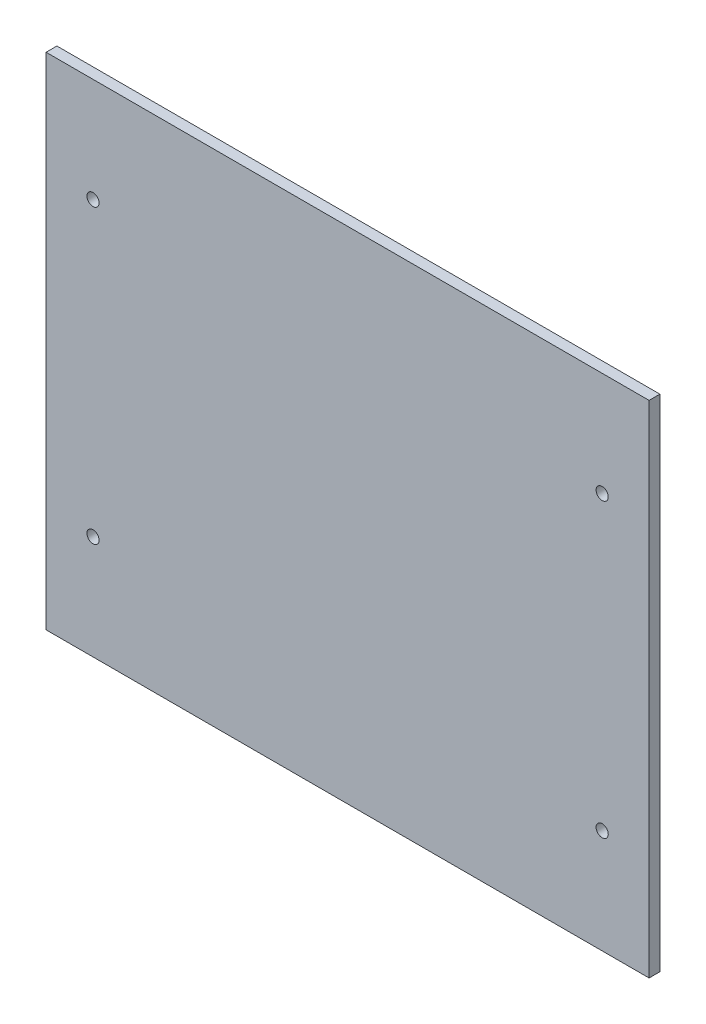
ISO-10303-21;
HEADER;
FILE_DESCRIPTION(('STEP AP214'),'2;1');
FILE_NAME('part.step','',(''),(''),'','','');
FILE_SCHEMA(('AUTOMOTIVE_DESIGN { 1 0 10303 214 1 1 1 1 }'));
ENDSEC;
DATA;
#1=APPLICATION_CONTEXT('core data for automotive mechanical design processes');
#2=APPLICATION_PROTOCOL_DEFINITION('international standard','automotive_design',2000,#1);
#3=PRODUCT_CONTEXT('',#1,'mechanical');
#4=PRODUCT('Part','Part','',(#3));
#5=PRODUCT_RELATED_PRODUCT_CATEGORY('part','',(#4));
#6=PRODUCT_DEFINITION_FORMATION('','',#4);
#7=PRODUCT_DEFINITION_CONTEXT('part definition',#1,'design');
#8=PRODUCT_DEFINITION('design','',#6,#7);
#9=PRODUCT_DEFINITION_SHAPE('','',#8);
#10=(LENGTH_UNIT() NAMED_UNIT(*) SI_UNIT(.MILLI.,.METRE.));
#11=(NAMED_UNIT(*) PLANE_ANGLE_UNIT() SI_UNIT($,.RADIAN.));
#12=(NAMED_UNIT(*) SI_UNIT($,.STERADIAN.) SOLID_ANGLE_UNIT());
#13=UNCERTAINTY_MEASURE_WITH_UNIT(LENGTH_MEASURE(1.E-05),#10,'distance_accuracy_value','');
#14=(GEOMETRIC_REPRESENTATION_CONTEXT(3) GLOBAL_UNCERTAINTY_ASSIGNED_CONTEXT((#13)) GLOBAL_UNIT_ASSIGNED_CONTEXT((#10,
#11,#12)) REPRESENTATION_CONTEXT('',''));
#15=CARTESIAN_POINT('',(0.,0.,0.));
#16=DIRECTION('',(0.,0.,1.));
#17=DIRECTION('',(1.,0.,0.));
#18=AXIS2_PLACEMENT_3D('',#15,#16,#17);
#19=CARTESIAN_POINT('',(0.,92.5,4.));
#20=DIRECTION('',(0.,-1.,0.));
#21=DIRECTION('',(1.,0.,0.));
#22=AXIS2_PLACEMENT_3D('',#19,#20,#21);
#23=PLANE('',#22);
#24=DIRECTION('',(-1.,0.,0.));
#25=VECTOR('',#24,1.);
#26=CARTESIAN_POINT('',(0.,92.5,0.));
#27=LINE('',#26,#25);
#28=CARTESIAN_POINT('',(111.5,92.5,0.));
#29=VERTEX_POINT('',#28);
#30=CARTESIAN_POINT('',(-111.5,92.5,0.));
#31=VERTEX_POINT('',#30);
#32=EDGE_CURVE('E126',#29,#31,#27,.T.);
#33=ORIENTED_EDGE('',*,*,#32,.T.);
#34=DIRECTION('',(0.,0.,-1.));
#35=VECTOR('',#34,1.);
#36=CARTESIAN_POINT('',(-111.5,92.5,4.));
#37=LINE('',#36,#35);
#38=CARTESIAN_POINT('',(-111.5,92.5,4.));
#39=VERTEX_POINT('',#38);
#40=EDGE_CURVE('E11',#39,#31,#37,.T.);
#41=ORIENTED_EDGE('',*,*,#40,.F.);
#42=DIRECTION('',(-1.,0.,0.));
#43=VECTOR('',#42,1.);
#44=CARTESIAN_POINT('',(0.,92.5,4.));
#45=LINE('',#44,#43);
#46=CARTESIAN_POINT('',(111.5,92.5,4.));
#47=VERTEX_POINT('',#46);
#48=EDGE_CURVE('E92',#47,#39,#45,.T.);
#49=ORIENTED_EDGE('',*,*,#48,.F.);
#50=DIRECTION('',(0.,0.,-1.));
#51=VECTOR('',#50,1.);
#52=CARTESIAN_POINT('',(111.5,92.5,4.));
#53=LINE('',#52,#51);
#54=EDGE_CURVE('E59',#47,#29,#53,.T.);
#55=ORIENTED_EDGE('',*,*,#54,.T.);
#56=EDGE_LOOP('',(#33,#41,#49,#55));
#57=FACE_BOUND('',#56,.T.);
#58=ADVANCED_FACE('F41',(#57),#23,.F.);
#59=CARTESIAN_POINT('',(-111.5,0.,4.));
#60=DIRECTION('',(1.,0.,0.));
#61=DIRECTION('',(0.,1.,0.));
#62=AXIS2_PLACEMENT_3D('',#59,#60,#61);
#63=PLANE('',#62);
#64=DIRECTION('',(0.,-1.,0.));
#65=VECTOR('',#64,1.);
#66=CARTESIAN_POINT('',(-111.5,0.,0.));
#67=LINE('',#66,#65);
#68=CARTESIAN_POINT('',(-111.5,-92.5,0.));
#69=VERTEX_POINT('',#68);
#70=EDGE_CURVE('E98',#31,#69,#67,.T.);
#71=ORIENTED_EDGE('',*,*,#70,.T.);
#72=DIRECTION('',(0.,0.,-1.));
#73=VECTOR('',#72,1.);
#74=CARTESIAN_POINT('',(-111.5,-92.5,4.));
#75=LINE('',#74,#73);
#76=CARTESIAN_POINT('',(-111.5,-92.5,4.));
#77=VERTEX_POINT('',#76);
#78=EDGE_CURVE('E51',#77,#69,#75,.T.);
#79=ORIENTED_EDGE('',*,*,#78,.F.);
#80=DIRECTION('',(0.,-1.,0.));
#81=VECTOR('',#80,1.);
#82=CARTESIAN_POINT('',(-111.5,0.,4.));
#83=LINE('',#82,#81);
#84=EDGE_CURVE('E84',#39,#77,#83,.T.);
#85=ORIENTED_EDGE('',*,*,#84,.F.);
#86=ORIENTED_EDGE('',*,*,#40,.T.);
#87=EDGE_LOOP('',(#71,#79,#85,#86));
#88=FACE_BOUND('',#87,.T.);
#89=ADVANCED_FACE('F97',(#88),#63,.F.);
#90=CARTESIAN_POINT('',(0.,-92.5,4.));
#91=DIRECTION('',(0.,-1.,0.));
#92=DIRECTION('',(1.,0.,0.));
#93=AXIS2_PLACEMENT_3D('',#90,#91,#92);
#94=PLANE('',#93);
#95=DIRECTION('',(-1.,0.,0.));
#96=VECTOR('',#95,1.);
#97=CARTESIAN_POINT('',(0.,-92.5,0.));
#98=LINE('',#97,#96);
#99=CARTESIAN_POINT('',(111.5,-92.5,0.));
#100=VERTEX_POINT('',#99);
#101=EDGE_CURVE('E131',#100,#69,#98,.T.);
#102=ORIENTED_EDGE('',*,*,#101,.F.);
#103=DIRECTION('',(0.,0.,-1.));
#104=VECTOR('',#103,1.);
#105=CARTESIAN_POINT('',(111.5,-92.5,4.));
#106=LINE('',#105,#104);
#107=CARTESIAN_POINT('',(111.5,-92.5,4.));
#108=VERTEX_POINT('',#107);
#109=EDGE_CURVE('E73',#108,#100,#106,.T.);
#110=ORIENTED_EDGE('',*,*,#109,.F.);
#111=DIRECTION('',(-1.,0.,0.));
#112=VECTOR('',#111,1.);
#113=CARTESIAN_POINT('',(0.,-92.5,4.));
#114=LINE('',#113,#112);
#115=EDGE_CURVE('E91',#108,#77,#114,.T.);
#116=ORIENTED_EDGE('',*,*,#115,.T.);
#117=ORIENTED_EDGE('',*,*,#78,.T.);
#118=EDGE_LOOP('',(#102,#110,#116,#117));
#119=FACE_BOUND('',#118,.T.);
#120=ADVANCED_FACE('F102',(#119),#94,.T.);
#121=CARTESIAN_POINT('',(-94.15,54.,4.));
#122=DIRECTION('',(0.,0.,-1.));
#123=DIRECTION('',(-1.,0.,0.));
#124=AXIS2_PLACEMENT_3D('',#121,#122,#123);
#125=CYLINDRICAL_SURFACE('',#124,2.25);
#126=CARTESIAN_POINT('',(-94.15,54.,4.));
#127=DIRECTION('',(0.,0.,1.));
#128=DIRECTION('',(1.,0.,0.));
#129=AXIS2_PLACEMENT_3D('',#126,#127,#128);
#130=CIRCLE('',#129,2.25);
#131=CARTESIAN_POINT('',(-91.9,54.,4.));
#132=VERTEX_POINT('',#131);
#133=EDGE_CURVE('E157',#132,#132,#130,.T.);
#134=ORIENTED_EDGE('',*,*,#133,.T.);
#135=EDGE_LOOP('',(#134));
#136=FACE_BOUND('',#135,.T.);
#137=CARTESIAN_POINT('',(-94.15,54.,0.));
#138=DIRECTION('',(0.,0.,1.));
#139=DIRECTION('',(1.,0.,0.));
#140=AXIS2_PLACEMENT_3D('',#137,#138,#139);
#141=CIRCLE('',#140,2.25);
#142=CARTESIAN_POINT('',(-91.9,54.,0.));
#143=VERTEX_POINT('',#142);
#144=EDGE_CURVE('E122',#143,#143,#141,.T.);
#145=ORIENTED_EDGE('',*,*,#144,.F.);
#146=EDGE_LOOP('',(#145));
#147=FACE_BOUND('',#146,.T.);
#148=ADVANCED_FACE('F163',(#136,#147),#125,.F.);
#149=CARTESIAN_POINT('',(94.15,54.,4.));
#150=DIRECTION('',(0.,0.,-1.));
#151=DIRECTION('',(-1.,0.,0.));
#152=AXIS2_PLACEMENT_3D('',#149,#150,#151);
#153=CYLINDRICAL_SURFACE('',#152,2.25);
#154=CARTESIAN_POINT('',(94.15,54.,4.));
#155=DIRECTION('',(0.,0.,1.));
#156=DIRECTION('',(1.,0.,0.));
#157=AXIS2_PLACEMENT_3D('',#154,#155,#156);
#158=CIRCLE('',#157,2.25);
#159=CARTESIAN_POINT('',(96.4,54.,4.));
#160=VERTEX_POINT('',#159);
#161=EDGE_CURVE('E151',#160,#160,#158,.T.);
#162=ORIENTED_EDGE('',*,*,#161,.T.);
#163=EDGE_LOOP('',(#162));
#164=FACE_BOUND('',#163,.T.);
#165=CARTESIAN_POINT('',(94.15,54.,0.));
#166=DIRECTION('',(0.,0.,1.));
#167=DIRECTION('',(1.,0.,0.));
#168=AXIS2_PLACEMENT_3D('',#165,#166,#167);
#169=CIRCLE('',#168,2.25);
#170=CARTESIAN_POINT('',(96.4,54.,0.));
#171=VERTEX_POINT('',#170);
#172=EDGE_CURVE('E118',#171,#171,#169,.T.);
#173=ORIENTED_EDGE('',*,*,#172,.F.);
#174=EDGE_LOOP('',(#173));
#175=FACE_BOUND('',#174,.T.);
#176=ADVANCED_FACE('F189',(#164,#175),#153,.F.);
#177=CARTESIAN_POINT('',(94.15,-54.,4.));
#178=DIRECTION('',(0.,0.,-1.));
#179=DIRECTION('',(-1.,0.,0.));
#180=AXIS2_PLACEMENT_3D('',#177,#178,#179);
#181=CYLINDRICAL_SURFACE('',#180,2.25);
#182=CARTESIAN_POINT('',(94.15,-54.,4.));
#183=DIRECTION('',(0.,0.,1.));
#184=DIRECTION('',(1.,0.,0.));
#185=AXIS2_PLACEMENT_3D('',#182,#183,#184);
#186=CIRCLE('',#185,2.25);
#187=CARTESIAN_POINT('',(96.4,-54.,4.));
#188=VERTEX_POINT('',#187);
#189=EDGE_CURVE('E145',#188,#188,#186,.T.);
#190=ORIENTED_EDGE('',*,*,#189,.T.);
#191=EDGE_LOOP('',(#190));
#192=FACE_BOUND('',#191,.T.);
#193=CARTESIAN_POINT('',(94.15,-54.,0.));
#194=DIRECTION('',(0.,0.,1.));
#195=DIRECTION('',(1.,0.,0.));
#196=AXIS2_PLACEMENT_3D('',#193,#194,#195);
#197=CIRCLE('',#196,2.25);
#198=CARTESIAN_POINT('',(96.4,-54.,0.));
#199=VERTEX_POINT('',#198);
#200=EDGE_CURVE('E114',#199,#199,#197,.T.);
#201=ORIENTED_EDGE('',*,*,#200,.F.);
#202=EDGE_LOOP('',(#201));
#203=FACE_BOUND('',#202,.T.);
#204=ADVANCED_FACE('F191',(#192,#203),#181,.F.);
#205=CARTESIAN_POINT('',(-94.15,-54.,4.));
#206=DIRECTION('',(0.,0.,-1.));
#207=DIRECTION('',(-1.,0.,0.));
#208=AXIS2_PLACEMENT_3D('',#205,#206,#207);
#209=CYLINDRICAL_SURFACE('',#208,2.25);
#210=CARTESIAN_POINT('',(-94.15,-54.,4.));
#211=DIRECTION('',(0.,0.,1.));
#212=DIRECTION('',(1.,0.,0.));
#213=AXIS2_PLACEMENT_3D('',#210,#211,#212);
#214=CIRCLE('',#213,2.25);
#215=CARTESIAN_POINT('',(-91.9,-54.,4.));
#216=VERTEX_POINT('',#215);
#217=EDGE_CURVE('E138',#216,#216,#214,.T.);
#218=ORIENTED_EDGE('',*,*,#217,.T.);
#219=EDGE_LOOP('',(#218));
#220=FACE_BOUND('',#219,.T.);
#221=CARTESIAN_POINT('',(-94.15,-54.,0.));
#222=DIRECTION('',(0.,0.,1.));
#223=DIRECTION('',(1.,0.,0.));
#224=AXIS2_PLACEMENT_3D('',#221,#222,#223);
#225=CIRCLE('',#224,2.25);
#226=CARTESIAN_POINT('',(-91.9,-54.,0.));
#227=VERTEX_POINT('',#226);
#228=EDGE_CURVE('E110',#227,#227,#225,.T.);
#229=ORIENTED_EDGE('',*,*,#228,.F.);
#230=EDGE_LOOP('',(#229));
#231=FACE_BOUND('',#230,.T.);
#232=ADVANCED_FACE('F43',(#220,#231),#209,.F.);
#233=CARTESIAN_POINT('',(111.5,0.,4.));
#234=DIRECTION('',(1.,0.,0.));
#235=DIRECTION('',(0.,1.,0.));
#236=AXIS2_PLACEMENT_3D('',#233,#234,#235);
#237=PLANE('',#236);
#238=DIRECTION('',(0.,-1.,0.));
#239=VECTOR('',#238,1.);
#240=CARTESIAN_POINT('',(111.5,0.,0.));
#241=LINE('',#240,#239);
#242=EDGE_CURVE('E134',#29,#100,#241,.T.);
#243=ORIENTED_EDGE('',*,*,#242,.F.);
#244=ORIENTED_EDGE('',*,*,#54,.F.);
#245=DIRECTION('',(0.,-1.,0.));
#246=VECTOR('',#245,1.);
#247=CARTESIAN_POINT('',(111.5,0.,4.));
#248=LINE('',#247,#246);
#249=EDGE_CURVE('E104',#47,#108,#248,.T.);
#250=ORIENTED_EDGE('',*,*,#249,.T.);
#251=ORIENTED_EDGE('',*,*,#109,.T.);
#252=EDGE_LOOP('',(#243,#244,#250,#251));
#253=FACE_BOUND('',#252,.T.);
#254=ADVANCED_FACE('F168',(#253),#237,.T.);
#255=CARTESIAN_POINT('',(0.,0.,4.));
#256=DIRECTION('',(0.,0.,1.));
#257=DIRECTION('',(1.,0.,0.));
#258=AXIS2_PLACEMENT_3D('',#255,#256,#257);
#259=PLANE('',#258);
#260=ORIENTED_EDGE('',*,*,#217,.F.);
#261=EDGE_LOOP('',(#260));
#262=FACE_BOUND('',#261,.T.);
#263=ORIENTED_EDGE('',*,*,#189,.F.);
#264=EDGE_LOOP('',(#263));
#265=FACE_BOUND('',#264,.T.);
#266=ORIENTED_EDGE('',*,*,#161,.F.);
#267=EDGE_LOOP('',(#266));
#268=FACE_BOUND('',#267,.T.);
#269=ORIENTED_EDGE('',*,*,#133,.F.);
#270=EDGE_LOOP('',(#269));
#271=FACE_BOUND('',#270,.T.);
#272=ORIENTED_EDGE('',*,*,#48,.T.);
#273=ORIENTED_EDGE('',*,*,#84,.T.);
#274=ORIENTED_EDGE('',*,*,#115,.F.);
#275=ORIENTED_EDGE('',*,*,#249,.F.);
#276=EDGE_LOOP('',(#272,#273,#274,#275));
#277=FACE_BOUND('',#276,.T.);
#278=ADVANCED_FACE('F88',(#262,#265,#268,#271,#277),#259,.T.);
#279=CARTESIAN_POINT('',(0.,0.,0.));
#280=DIRECTION('',(0.,0.,1.));
#281=DIRECTION('',(1.,0.,0.));
#282=AXIS2_PLACEMENT_3D('',#279,#280,#281);
#283=PLANE('',#282);
#284=ORIENTED_EDGE('',*,*,#228,.T.);
#285=EDGE_LOOP('',(#284));
#286=FACE_BOUND('',#285,.T.);
#287=ORIENTED_EDGE('',*,*,#200,.T.);
#288=EDGE_LOOP('',(#287));
#289=FACE_BOUND('',#288,.T.);
#290=ORIENTED_EDGE('',*,*,#172,.T.);
#291=EDGE_LOOP('',(#290));
#292=FACE_BOUND('',#291,.T.);
#293=ORIENTED_EDGE('',*,*,#144,.T.);
#294=EDGE_LOOP('',(#293));
#295=FACE_BOUND('',#294,.T.);
#296=ORIENTED_EDGE('',*,*,#32,.F.);
#297=ORIENTED_EDGE('',*,*,#242,.T.);
#298=ORIENTED_EDGE('',*,*,#101,.T.);
#299=ORIENTED_EDGE('',*,*,#70,.F.);
#300=EDGE_LOOP('',(#296,#297,#298,#299));
#301=FACE_BOUND('',#300,.T.);
#302=ADVANCED_FACE('F167',(#286,#289,#292,#295,#301),#283,.F.);
#303=CLOSED_SHELL('',(#58,#89,#120,#148,#176,#204,#232,#254,#278,#302));
#304=MANIFOLD_SOLID_BREP('B2',#303);
#305=ADVANCED_BREP_SHAPE_REPRESENTATION('',(#18,#304),#14);
#306=SHAPE_DEFINITION_REPRESENTATION(#9,#305);
ENDSEC;
END-ISO-10303-21;
